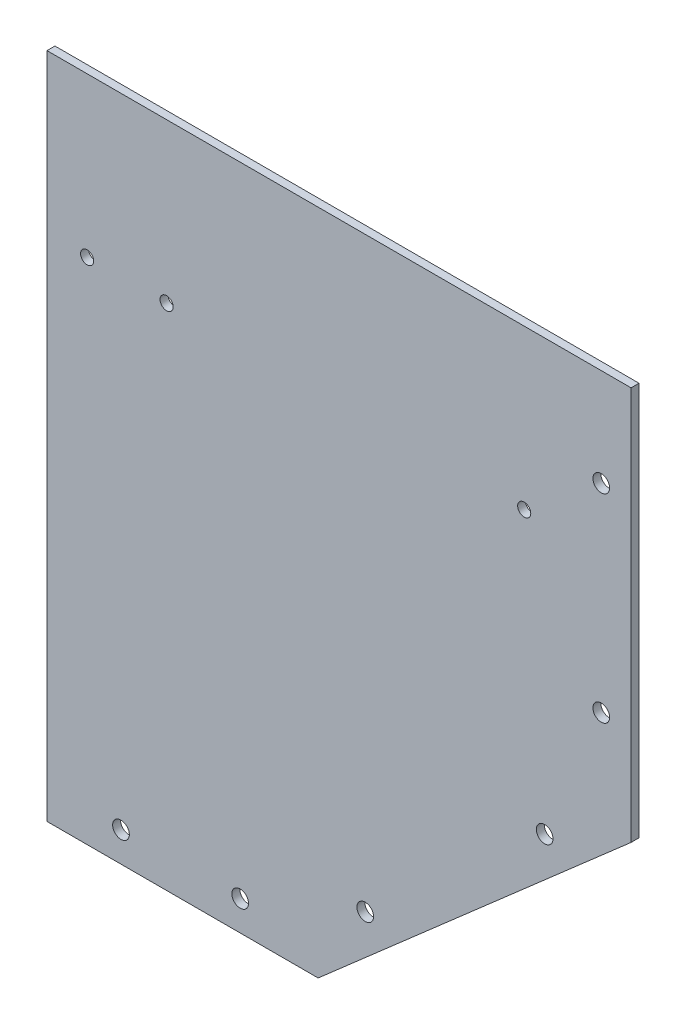
ISO-10303-21;
HEADER;
FILE_DESCRIPTION(('STEP AP214'),'2;1');
FILE_NAME('part.step','',(''),(''),'','','');
FILE_SCHEMA(('AUTOMOTIVE_DESIGN { 1 0 10303 214 1 1 1 1 }'));
ENDSEC;
DATA;
#1=APPLICATION_CONTEXT('core data for automotive mechanical design processes');
#2=APPLICATION_PROTOCOL_DEFINITION('international standard','automotive_design',2000,#1);
#3=PRODUCT_CONTEXT('',#1,'mechanical');
#4=PRODUCT('Part','Part','',(#3));
#5=PRODUCT_RELATED_PRODUCT_CATEGORY('part','',(#4));
#6=PRODUCT_DEFINITION_FORMATION('','',#4);
#7=PRODUCT_DEFINITION_CONTEXT('part definition',#1,'design');
#8=PRODUCT_DEFINITION('design','',#6,#7);
#9=PRODUCT_DEFINITION_SHAPE('','',#8);
#10=(LENGTH_UNIT() NAMED_UNIT(*) SI_UNIT(.MILLI.,.METRE.));
#11=(NAMED_UNIT(*) PLANE_ANGLE_UNIT() SI_UNIT($,.RADIAN.));
#12=(NAMED_UNIT(*) SI_UNIT($,.STERADIAN.) SOLID_ANGLE_UNIT());
#13=UNCERTAINTY_MEASURE_WITH_UNIT(LENGTH_MEASURE(1.E-05),#10,'distance_accuracy_value','');
#14=(GEOMETRIC_REPRESENTATION_CONTEXT(3) GLOBAL_UNCERTAINTY_ASSIGNED_CONTEXT((#13)) GLOBAL_UNIT_ASSIGNED_CONTEXT((#10,
#11,#12)) REPRESENTATION_CONTEXT('',''));
#15=CARTESIAN_POINT('',(0.,0.,0.));
#16=DIRECTION('',(0.,0.,1.));
#17=DIRECTION('',(1.,0.,0.));
#18=AXIS2_PLACEMENT_3D('',#15,#16,#17);
#19=CARTESIAN_POINT('',(0.,0.,2.));
#20=DIRECTION('',(0.,1.,0.));
#21=DIRECTION('',(0.,0.,1.));
#22=AXIS2_PLACEMENT_3D('',#19,#20,#21);
#23=PLANE('',#22);
#24=DIRECTION('',(1.,0.,0.));
#25=VECTOR('',#24,1.);
#26=CARTESIAN_POINT('',(0.,0.,0.));
#27=LINE('',#26,#25);
#28=CARTESIAN_POINT('',(0.,0.,0.));
#29=VERTEX_POINT('',#28);
#30=CARTESIAN_POINT('',(68.24,0.,0.));
#31=VERTEX_POINT('',#30);
#32=EDGE_CURVE('E133',#29,#31,#27,.T.);
#33=ORIENTED_EDGE('',*,*,#32,.T.);
#34=DIRECTION('',(0.,0.,-1.));
#35=VECTOR('',#34,1.);
#36=CARTESIAN_POINT('',(68.24,0.,2.));
#37=LINE('',#36,#35);
#38=CARTESIAN_POINT('',(68.24,0.,2.));
#39=VERTEX_POINT('',#38);
#40=EDGE_CURVE('E11',#39,#31,#37,.T.);
#41=ORIENTED_EDGE('',*,*,#40,.F.);
#42=DIRECTION('',(1.,0.,0.));
#43=VECTOR('',#42,1.);
#44=CARTESIAN_POINT('',(0.,0.,2.));
#45=LINE('',#44,#43);
#46=CARTESIAN_POINT('',(0.,0.,2.));
#47=VERTEX_POINT('',#46);
#48=EDGE_CURVE('E179',#47,#39,#45,.T.);
#49=ORIENTED_EDGE('',*,*,#48,.F.);
#50=DIRECTION('',(0.,0.,-1.));
#51=VECTOR('',#50,1.);
#52=CARTESIAN_POINT('',(0.,0.,2.));
#53=LINE('',#52,#51);
#54=EDGE_CURVE('E110',#47,#29,#53,.T.);
#55=ORIENTED_EDGE('',*,*,#54,.T.);
#56=EDGE_LOOP('',(#33,#41,#49,#55));
#57=FACE_BOUND('',#56,.T.);
#58=ADVANCED_FACE('F37',(#57),#23,.F.);
#59=CARTESIAN_POINT('',(29.5956067368034,-33.8186969825855,2.));
#60=DIRECTION('',(-0.658558128911921,0.752529860433478,0.));
#61=DIRECTION('',(-0.752529860433478,-0.658558128911921,0.));
#62=AXIS2_PLACEMENT_3D('',#59,#60,#61);
#63=PLANE('',#62);
#64=DIRECTION('',(0.752529860433478,0.658558128911921,0.));
#65=VECTOR('',#64,1.);
#66=CARTESIAN_POINT('',(29.5956067368034,-33.8186969825855,0.));
#67=LINE('',#66,#65);
#68=CARTESIAN_POINT('',(146.992249894363,68.9181081906326,0.));
#69=VERTEX_POINT('',#68);
#70=EDGE_CURVE('E136',#31,#69,#67,.T.);
#71=ORIENTED_EDGE('',*,*,#70,.T.);
#72=DIRECTION('',(0.,0.,-1.));
#73=VECTOR('',#72,1.);
#74=CARTESIAN_POINT('',(146.992249894363,68.9181081906326,2.));
#75=LINE('',#74,#73);
#76=CARTESIAN_POINT('',(146.992249894363,68.9181081906326,2.));
#77=VERTEX_POINT('',#76);
#78=EDGE_CURVE('E47',#77,#69,#75,.T.);
#79=ORIENTED_EDGE('',*,*,#78,.F.);
#80=DIRECTION('',(0.752529860433478,0.658558128911921,0.));
#81=VECTOR('',#80,1.);
#82=CARTESIAN_POINT('',(29.5956067368034,-33.8186969825855,2.));
#83=LINE('',#82,#81);
#84=EDGE_CURVE('E90',#39,#77,#83,.T.);
#85=ORIENTED_EDGE('',*,*,#84,.F.);
#86=ORIENTED_EDGE('',*,*,#40,.T.);
#87=EDGE_LOOP('',(#71,#79,#85,#86));
#88=FACE_BOUND('',#87,.T.);
#89=ADVANCED_FACE('F184',(#88),#63,.F.);
#90=CARTESIAN_POINT('',(146.992249894364,1.23517305978068E-13,2.));
#91=DIRECTION('',(-1.,0.,0.));
#92=DIRECTION('',(0.,-1.,0.));
#93=AXIS2_PLACEMENT_3D('',#90,#91,#92);
#94=PLANE('',#93);
#95=DIRECTION('',(0.,1.,0.));
#96=VECTOR('',#95,1.);
#97=CARTESIAN_POINT('',(146.992249894364,1.23517305978068E-13,0.));
#98=LINE('',#97,#96);
#99=CARTESIAN_POINT('',(146.992249894363,168.01,0.));
#100=VERTEX_POINT('',#99);
#101=EDGE_CURVE('E105',#69,#100,#98,.T.);
#102=ORIENTED_EDGE('',*,*,#101,.T.);
#103=DIRECTION('',(0.,0.,-1.));
#104=VECTOR('',#103,1.);
#105=CARTESIAN_POINT('',(146.992249894363,168.01,2.));
#106=LINE('',#105,#104);
#107=CARTESIAN_POINT('',(146.992249894363,168.01,2.));
#108=VERTEX_POINT('',#107);
#109=EDGE_CURVE('E102',#108,#100,#106,.T.);
#110=ORIENTED_EDGE('',*,*,#109,.F.);
#111=DIRECTION('',(0.,1.,0.));
#112=VECTOR('',#111,1.);
#113=CARTESIAN_POINT('',(146.992249894364,1.23517305978068E-13,2.));
#114=LINE('',#113,#112);
#115=EDGE_CURVE('E94',#77,#108,#114,.T.);
#116=ORIENTED_EDGE('',*,*,#115,.F.);
#117=ORIENTED_EDGE('',*,*,#78,.T.);
#118=EDGE_LOOP('',(#102,#110,#116,#117));
#119=FACE_BOUND('',#118,.T.);
#120=ADVANCED_FACE('F103',(#119),#94,.F.);
#121=CARTESIAN_POINT('',(0.,168.01,2.));
#122=DIRECTION('',(0.,-1.,0.));
#123=DIRECTION('',(1.,0.,0.));
#124=AXIS2_PLACEMENT_3D('',#121,#122,#123);
#125=PLANE('',#124);
#126=DIRECTION('',(-1.,0.,0.));
#127=VECTOR('',#126,1.);
#128=CARTESIAN_POINT('',(0.,168.01,0.));
#129=LINE('',#128,#127);
#130=CARTESIAN_POINT('',(0.,168.01,0.));
#131=VERTEX_POINT('',#130);
#132=EDGE_CURVE('E76',#100,#131,#129,.T.);
#133=ORIENTED_EDGE('',*,*,#132,.T.);
#134=DIRECTION('',(0.,0.,-1.));
#135=VECTOR('',#134,1.);
#136=CARTESIAN_POINT('',(0.,168.01,2.));
#137=LINE('',#136,#135);
#138=CARTESIAN_POINT('',(0.,168.01,2.));
#139=VERTEX_POINT('',#138);
#140=EDGE_CURVE('E106',#139,#131,#137,.T.);
#141=ORIENTED_EDGE('',*,*,#140,.F.);
#142=DIRECTION('',(-1.,0.,0.));
#143=VECTOR('',#142,1.);
#144=CARTESIAN_POINT('',(0.,168.01,2.));
#145=LINE('',#144,#143);
#146=EDGE_CURVE('E98',#108,#139,#145,.T.);
#147=ORIENTED_EDGE('',*,*,#146,.F.);
#148=ORIENTED_EDGE('',*,*,#109,.T.);
#149=EDGE_LOOP('',(#133,#141,#147,#148));
#150=FACE_BOUND('',#149,.T.);
#151=ADVANCED_FACE('F108',(#150),#125,.F.);
#152=CARTESIAN_POINT('',(48.62,7.5,2.));
#153=DIRECTION('',(0.,0.,-1.));
#154=DIRECTION('',(-1.,0.,0.));
#155=AXIS2_PLACEMENT_3D('',#152,#153,#154);
#156=CYLINDRICAL_SURFACE('',#155,2.1);
#157=CARTESIAN_POINT('',(48.62,7.5,2.));
#158=DIRECTION('',(0.,0.,1.));
#159=DIRECTION('',(1.,0.,0.));
#160=AXIS2_PLACEMENT_3D('',#157,#158,#159);
#161=CIRCLE('',#160,2.1);
#162=CARTESIAN_POINT('',(50.72,7.5,2.));
#163=VERTEX_POINT('',#162);
#164=EDGE_CURVE('E176',#163,#163,#161,.T.);
#165=ORIENTED_EDGE('',*,*,#164,.T.);
#166=EDGE_LOOP('',(#165));
#167=FACE_BOUND('',#166,.T.);
#168=CARTESIAN_POINT('',(48.62,7.5,0.));
#169=DIRECTION('',(0.,0.,1.));
#170=DIRECTION('',(1.,0.,0.));
#171=AXIS2_PLACEMENT_3D('',#168,#169,#170);
#172=CIRCLE('',#171,2.1);
#173=CARTESIAN_POINT('',(50.72,7.5,0.));
#174=VERTEX_POINT('',#173);
#175=EDGE_CURVE('E130',#174,#174,#172,.T.);
#176=ORIENTED_EDGE('',*,*,#175,.F.);
#177=EDGE_LOOP('',(#176));
#178=FACE_BOUND('',#177,.T.);
#179=ADVANCED_FACE('F210',(#167,#178),#156,.F.);
#180=CARTESIAN_POINT('',(18.62,7.5,2.));
#181=DIRECTION('',(0.,0.,-1.));
#182=DIRECTION('',(-1.,0.,0.));
#183=AXIS2_PLACEMENT_3D('',#180,#181,#182);
#184=CYLINDRICAL_SURFACE('',#183,2.1);
#185=CARTESIAN_POINT('',(18.62,7.5,2.));
#186=DIRECTION('',(0.,0.,1.));
#187=DIRECTION('',(1.,0.,0.));
#188=AXIS2_PLACEMENT_3D('',#185,#186,#187);
#189=CIRCLE('',#188,2.1);
#190=CARTESIAN_POINT('',(20.72,7.5,2.));
#191=VERTEX_POINT('',#190);
#192=EDGE_CURVE('E173',#191,#191,#189,.T.);
#193=ORIENTED_EDGE('',*,*,#192,.T.);
#194=EDGE_LOOP('',(#193));
#195=FACE_BOUND('',#194,.T.);
#196=CARTESIAN_POINT('',(18.62,7.5,0.));
#197=DIRECTION('',(0.,0.,1.));
#198=DIRECTION('',(1.,0.,0.));
#199=AXIS2_PLACEMENT_3D('',#196,#197,#198);
#200=CIRCLE('',#199,2.1);
#201=CARTESIAN_POINT('',(20.72,7.5,0.));
#202=VERTEX_POINT('',#201);
#203=EDGE_CURVE('E127',#202,#202,#200,.T.);
#204=ORIENTED_EDGE('',*,*,#203,.F.);
#205=EDGE_LOOP('',(#204));
#206=FACE_BOUND('',#205,.T.);
#207=ADVANCED_FACE('F213',(#195,#206),#184,.F.);
#208=CARTESIAN_POINT('',(139.492249894363,143.468108190633,2.));
#209=DIRECTION('',(0.,0.,-1.));
#210=DIRECTION('',(-1.,0.,0.));
#211=AXIS2_PLACEMENT_3D('',#208,#209,#210);
#212=CYLINDRICAL_SURFACE('',#211,2.09999999999999);
#213=CARTESIAN_POINT('',(139.492249894363,143.468108190633,2.));
#214=DIRECTION('',(0.,0.,1.));
#215=DIRECTION('',(1.,0.,0.));
#216=AXIS2_PLACEMENT_3D('',#213,#214,#215);
#217=CIRCLE('',#216,2.09999999999999);
#218=CARTESIAN_POINT('',(141.592249894363,143.468108190633,2.));
#219=VERTEX_POINT('',#218);
#220=EDGE_CURVE('E170',#219,#219,#217,.T.);
#221=ORIENTED_EDGE('',*,*,#220,.T.);
#222=EDGE_LOOP('',(#221));
#223=FACE_BOUND('',#222,.T.);
#224=CARTESIAN_POINT('',(139.492249894363,143.468108190633,0.));
#225=DIRECTION('',(0.,0.,1.));
#226=DIRECTION('',(1.,0.,0.));
#227=AXIS2_PLACEMENT_3D('',#224,#225,#226);
#228=CIRCLE('',#227,2.09999999999999);
#229=CARTESIAN_POINT('',(141.592249894363,143.468108190633,0.));
#230=VERTEX_POINT('',#229);
#231=EDGE_CURVE('E124',#230,#230,#228,.T.);
#232=ORIENTED_EDGE('',*,*,#231,.F.);
#233=EDGE_LOOP('',(#232));
#234=FACE_BOUND('',#233,.T.);
#235=ADVANCED_FACE('F217',(#223,#234),#212,.F.);
#236=CARTESIAN_POINT('',(139.492249894363,93.4681081906326,2.));
#237=DIRECTION('',(0.,0.,-1.));
#238=DIRECTION('',(-1.,0.,0.));
#239=AXIS2_PLACEMENT_3D('',#236,#237,#238);
#240=CYLINDRICAL_SURFACE('',#239,2.09999999999999);
#241=CARTESIAN_POINT('',(139.492249894363,93.4681081906326,2.));
#242=DIRECTION('',(0.,0.,1.));
#243=DIRECTION('',(1.,0.,0.));
#244=AXIS2_PLACEMENT_3D('',#241,#242,#243);
#245=CIRCLE('',#244,2.09999999999999);
#246=CARTESIAN_POINT('',(141.592249894363,93.4681081906326,2.));
#247=VERTEX_POINT('',#246);
#248=EDGE_CURVE('E167',#247,#247,#245,.T.);
#249=ORIENTED_EDGE('',*,*,#248,.T.);
#250=EDGE_LOOP('',(#249));
#251=FACE_BOUND('',#250,.T.);
#252=CARTESIAN_POINT('',(139.492249894363,93.4681081906326,0.));
#253=DIRECTION('',(0.,0.,1.));
#254=DIRECTION('',(1.,0.,0.));
#255=AXIS2_PLACEMENT_3D('',#252,#253,#254);
#256=CIRCLE('',#255,2.09999999999999);
#257=CARTESIAN_POINT('',(141.592249894363,93.4681081906326,0.));
#258=VERTEX_POINT('',#257);
#259=EDGE_CURVE('E121',#258,#258,#256,.T.);
#260=ORIENTED_EDGE('',*,*,#259,.F.);
#261=EDGE_LOOP('',(#260));
#262=FACE_BOUND('',#261,.T.);
#263=ADVANCED_FACE('F221',(#251,#262),#240,.F.);
#264=CARTESIAN_POINT('',(80.0972805180358,20.3429913905652,2.));
#265=DIRECTION('',(0.,0.,-1.));
#266=DIRECTION('',(-1.,0.,0.));
#267=AXIS2_PLACEMENT_3D('',#264,#265,#266);
#268=CYLINDRICAL_SURFACE('',#267,2.1);
#269=CARTESIAN_POINT('',(80.0972805180358,20.3429913905652,2.));
#270=DIRECTION('',(0.,0.,1.));
#271=DIRECTION('',(1.,0.,0.));
#272=AXIS2_PLACEMENT_3D('',#269,#270,#271);
#273=CIRCLE('',#272,2.1);
#274=CARTESIAN_POINT('',(82.1972805180358,20.3429913905652,2.));
#275=VERTEX_POINT('',#274);
#276=EDGE_CURVE('E164',#275,#275,#273,.T.);
#277=ORIENTED_EDGE('',*,*,#276,.T.);
#278=EDGE_LOOP('',(#277));
#279=FACE_BOUND('',#278,.T.);
#280=CARTESIAN_POINT('',(80.0972805180358,20.3429913905652,0.));
#281=DIRECTION('',(0.,0.,1.));
#282=DIRECTION('',(1.,0.,0.));
#283=AXIS2_PLACEMENT_3D('',#280,#281,#282);
#284=CIRCLE('',#283,2.1);
#285=CARTESIAN_POINT('',(82.1972805180358,20.3429913905652,0.));
#286=VERTEX_POINT('',#285);
#287=EDGE_CURVE('E117',#286,#286,#284,.T.);
#288=ORIENTED_EDGE('',*,*,#287,.F.);
#289=EDGE_LOOP('',(#288));
#290=FACE_BOUND('',#289,.T.);
#291=ADVANCED_FACE('F224',(#279,#290),#268,.F.);
#292=CARTESIAN_POINT('',(125.249072144044,59.8564791252805,2.));
#293=DIRECTION('',(0.,0.,-1.));
#294=DIRECTION('',(-1.,0.,0.));
#295=AXIS2_PLACEMENT_3D('',#292,#293,#294);
#296=CYLINDRICAL_SURFACE('',#295,2.09999999999999);
#297=CARTESIAN_POINT('',(125.249072144044,59.8564791252805,2.));
#298=DIRECTION('',(0.,0.,1.));
#299=DIRECTION('',(1.,0.,0.));
#300=AXIS2_PLACEMENT_3D('',#297,#298,#299);
#301=CIRCLE('',#300,2.09999999999999);
#302=CARTESIAN_POINT('',(127.349072144044,59.8564791252805,2.));
#303=VERTEX_POINT('',#302);
#304=EDGE_CURVE('E141',#303,#303,#301,.T.);
#305=ORIENTED_EDGE('',*,*,#304,.T.);
#306=EDGE_LOOP('',(#305));
#307=FACE_BOUND('',#306,.T.);
#308=CARTESIAN_POINT('',(125.249072144044,59.8564791252805,0.));
#309=DIRECTION('',(0.,0.,1.));
#310=DIRECTION('',(1.,0.,0.));
#311=AXIS2_PLACEMENT_3D('',#308,#309,#310);
#312=CIRCLE('',#311,2.09999999999999);
#313=CARTESIAN_POINT('',(127.349072144044,59.8564791252805,0.));
#314=VERTEX_POINT('',#313);
#315=EDGE_CURVE('E114',#314,#314,#312,.T.);
#316=ORIENTED_EDGE('',*,*,#315,.F.);
#317=EDGE_LOOP('',(#316));
#318=FACE_BOUND('',#317,.T.);
#319=ADVANCED_FACE('F39',(#307,#318),#296,.F.);
#320=CARTESIAN_POINT('',(0.,0.,2.));
#321=DIRECTION('',(1.,0.,0.));
#322=DIRECTION('',(0.,1.,0.));
#323=AXIS2_PLACEMENT_3D('',#320,#321,#322);
#324=PLANE('',#323);
#325=DIRECTION('',(0.,-1.,0.));
#326=VECTOR('',#325,1.);
#327=CARTESIAN_POINT('',(0.,0.,0.));
#328=LINE('',#327,#326);
#329=EDGE_CURVE('E82',#131,#29,#328,.T.);
#330=ORIENTED_EDGE('',*,*,#329,.T.);
#331=ORIENTED_EDGE('',*,*,#54,.F.);
#332=DIRECTION('',(0.,-1.,0.));
#333=VECTOR('',#332,1.);
#334=CARTESIAN_POINT('',(0.,0.,2.));
#335=LINE('',#334,#333);
#336=EDGE_CURVE('E56',#139,#47,#335,.T.);
#337=ORIENTED_EDGE('',*,*,#336,.F.);
#338=ORIENTED_EDGE('',*,*,#140,.T.);
#339=EDGE_LOOP('',(#330,#331,#337,#338));
#340=FACE_BOUND('',#339,.T.);
#341=ADVANCED_FACE('F198',(#340),#324,.F.);
#342=CARTESIAN_POINT('',(0.,0.,2.));
#343=DIRECTION('',(0.,0.,1.));
#344=DIRECTION('',(1.,0.,0.));
#345=AXIS2_PLACEMENT_3D('',#342,#343,#344);
#346=PLANE('',#345);
#347=CARTESIAN_POINT('',(10.1,128.01,2.));
#348=DIRECTION('',(0.,0.,1.));
#349=DIRECTION('',(1.,0.,0.));
#350=AXIS2_PLACEMENT_3D('',#347,#348,#349);
#351=CIRCLE('',#350,1.64999999999999);
#352=CARTESIAN_POINT('',(11.75,128.01,2.));
#353=VERTEX_POINT('',#352);
#354=EDGE_CURVE('E159',#353,#353,#351,.T.);
#355=ORIENTED_EDGE('',*,*,#354,.F.);
#356=EDGE_LOOP('',(#355));
#357=FACE_BOUND('',#356,.T.);
#358=CARTESIAN_POINT('',(30.1,128.01,2.));
#359=DIRECTION('',(0.,0.,1.));
#360=DIRECTION('',(1.,0.,0.));
#361=AXIS2_PLACEMENT_3D('',#358,#359,#360);
#362=CIRCLE('',#361,1.64999999999999);
#363=CARTESIAN_POINT('',(31.75,128.01,2.));
#364=VERTEX_POINT('',#363);
#365=EDGE_CURVE('E149',#364,#364,#362,.T.);
#366=ORIENTED_EDGE('',*,*,#365,.F.);
#367=EDGE_LOOP('',(#366));
#368=FACE_BOUND('',#367,.T.);
#369=CARTESIAN_POINT('',(120.1,128.01,2.));
#370=DIRECTION('',(0.,0.,1.));
#371=DIRECTION('',(1.,0.,0.));
#372=AXIS2_PLACEMENT_3D('',#369,#370,#371);
#373=CIRCLE('',#372,1.64999999999998);
#374=CARTESIAN_POINT('',(121.75,128.01,2.));
#375=VERTEX_POINT('',#374);
#376=EDGE_CURVE('E146',#375,#375,#373,.T.);
#377=ORIENTED_EDGE('',*,*,#376,.F.);
#378=EDGE_LOOP('',(#377));
#379=FACE_BOUND('',#378,.T.);
#380=ORIENTED_EDGE('',*,*,#304,.F.);
#381=EDGE_LOOP('',(#380));
#382=FACE_BOUND('',#381,.T.);
#383=ORIENTED_EDGE('',*,*,#276,.F.);
#384=EDGE_LOOP('',(#383));
#385=FACE_BOUND('',#384,.T.);
#386=ORIENTED_EDGE('',*,*,#248,.F.);
#387=EDGE_LOOP('',(#386));
#388=FACE_BOUND('',#387,.T.);
#389=ORIENTED_EDGE('',*,*,#220,.F.);
#390=EDGE_LOOP('',(#389));
#391=FACE_BOUND('',#390,.T.);
#392=ORIENTED_EDGE('',*,*,#192,.F.);
#393=EDGE_LOOP('',(#392));
#394=FACE_BOUND('',#393,.T.);
#395=ORIENTED_EDGE('',*,*,#164,.F.);
#396=EDGE_LOOP('',(#395));
#397=FACE_BOUND('',#396,.T.);
#398=ORIENTED_EDGE('',*,*,#48,.T.);
#399=ORIENTED_EDGE('',*,*,#84,.T.);
#400=ORIENTED_EDGE('',*,*,#115,.T.);
#401=ORIENTED_EDGE('',*,*,#146,.T.);
#402=ORIENTED_EDGE('',*,*,#336,.T.);
#403=EDGE_LOOP('',(#398,#399,#400,#401,#402));
#404=FACE_BOUND('',#403,.T.);
#405=ADVANCED_FACE('F96',(#357,#368,#379,#382,#385,#388,#391,#394,#397,#404),#346,.T.);
#406=CARTESIAN_POINT('',(0.,0.,0.));
#407=DIRECTION('',(0.,0.,1.));
#408=DIRECTION('',(1.,0.,0.));
#409=AXIS2_PLACEMENT_3D('',#406,#407,#408);
#410=PLANE('',#409);
#411=CARTESIAN_POINT('',(10.1,128.01,0.));
#412=DIRECTION('',(0.,0.,1.));
#413=DIRECTION('',(1.,0.,0.));
#414=AXIS2_PLACEMENT_3D('',#411,#412,#413);
#415=CIRCLE('',#414,1.64999999999999);
#416=CARTESIAN_POINT('',(11.75,128.01,0.));
#417=VERTEX_POINT('',#416);
#418=EDGE_CURVE('E41',#417,#417,#415,.T.);
#419=ORIENTED_EDGE('',*,*,#418,.T.);
#420=EDGE_LOOP('',(#419));
#421=FACE_BOUND('',#420,.T.);
#422=CARTESIAN_POINT('',(30.1,128.01,0.));
#423=DIRECTION('',(0.,0.,1.));
#424=DIRECTION('',(1.,0.,0.));
#425=AXIS2_PLACEMENT_3D('',#422,#423,#424);
#426=CIRCLE('',#425,1.64999999999999);
#427=CARTESIAN_POINT('',(31.75,128.01,0.));
#428=VERTEX_POINT('',#427);
#429=EDGE_CURVE('E147',#428,#428,#426,.T.);
#430=ORIENTED_EDGE('',*,*,#429,.T.);
#431=EDGE_LOOP('',(#430));
#432=FACE_BOUND('',#431,.T.);
#433=CARTESIAN_POINT('',(120.1,128.01,0.));
#434=DIRECTION('',(0.,0.,1.));
#435=DIRECTION('',(1.,0.,0.));
#436=AXIS2_PLACEMENT_3D('',#433,#434,#435);
#437=CIRCLE('',#436,1.64999999999998);
#438=CARTESIAN_POINT('',(121.75,128.01,0.));
#439=VERTEX_POINT('',#438);
#440=EDGE_CURVE('E118',#439,#439,#437,.T.);
#441=ORIENTED_EDGE('',*,*,#440,.T.);
#442=EDGE_LOOP('',(#441));
#443=FACE_BOUND('',#442,.T.);
#444=ORIENTED_EDGE('',*,*,#315,.T.);
#445=EDGE_LOOP('',(#444));
#446=FACE_BOUND('',#445,.T.);
#447=ORIENTED_EDGE('',*,*,#287,.T.);
#448=EDGE_LOOP('',(#447));
#449=FACE_BOUND('',#448,.T.);
#450=ORIENTED_EDGE('',*,*,#259,.T.);
#451=EDGE_LOOP('',(#450));
#452=FACE_BOUND('',#451,.T.);
#453=ORIENTED_EDGE('',*,*,#231,.T.);
#454=EDGE_LOOP('',(#453));
#455=FACE_BOUND('',#454,.T.);
#456=ORIENTED_EDGE('',*,*,#203,.T.);
#457=EDGE_LOOP('',(#456));
#458=FACE_BOUND('',#457,.T.);
#459=ORIENTED_EDGE('',*,*,#175,.T.);
#460=EDGE_LOOP('',(#459));
#461=FACE_BOUND('',#460,.T.);
#462=ORIENTED_EDGE('',*,*,#32,.F.);
#463=ORIENTED_EDGE('',*,*,#329,.F.);
#464=ORIENTED_EDGE('',*,*,#132,.F.);
#465=ORIENTED_EDGE('',*,*,#101,.F.);
#466=ORIENTED_EDGE('',*,*,#70,.F.);
#467=EDGE_LOOP('',(#462,#463,#464,#465,#466));
#468=FACE_BOUND('',#467,.T.);
#469=ADVANCED_FACE('F186',(#421,#432,#443,#446,#449,#452,#455,#458,#461,#468),#410,.F.);
#470=CARTESIAN_POINT('',(120.1,128.01,2.));
#471=DIRECTION('',(0.,0.,1.));
#472=DIRECTION('',(1.,0.,0.));
#473=AXIS2_PLACEMENT_3D('',#470,#471,#472);
#474=CYLINDRICAL_SURFACE('',#473,1.64999999999998);
#475=ORIENTED_EDGE('',*,*,#376,.T.);
#476=EDGE_LOOP('',(#475));
#477=FACE_BOUND('',#476,.T.);
#478=ORIENTED_EDGE('',*,*,#440,.F.);
#479=EDGE_LOOP('',(#478));
#480=FACE_BOUND('',#479,.T.);
#481=ADVANCED_FACE('F188',(#477,#480),#474,.F.);
#482=CARTESIAN_POINT('',(30.1,128.01,2.));
#483=DIRECTION('',(0.,0.,1.));
#484=DIRECTION('',(1.,0.,0.));
#485=AXIS2_PLACEMENT_3D('',#482,#483,#484);
#486=CYLINDRICAL_SURFACE('',#485,1.64999999999999);
#487=ORIENTED_EDGE('',*,*,#365,.T.);
#488=EDGE_LOOP('',(#487));
#489=FACE_BOUND('',#488,.T.);
#490=ORIENTED_EDGE('',*,*,#429,.F.);
#491=EDGE_LOOP('',(#490));
#492=FACE_BOUND('',#491,.T.);
#493=ADVANCED_FACE('F195',(#489,#492),#486,.F.);
#494=CARTESIAN_POINT('',(10.1,128.01,2.));
#495=DIRECTION('',(0.,0.,1.));
#496=DIRECTION('',(1.,0.,0.));
#497=AXIS2_PLACEMENT_3D('',#494,#495,#496);
#498=CYLINDRICAL_SURFACE('',#497,1.64999999999999);
#499=ORIENTED_EDGE('',*,*,#354,.T.);
#500=EDGE_LOOP('',(#499));
#501=FACE_BOUND('',#500,.T.);
#502=ORIENTED_EDGE('',*,*,#418,.F.);
#503=EDGE_LOOP('',(#502));
#504=FACE_BOUND('',#503,.T.);
#505=ADVANCED_FACE('F334',(#501,#504),#498,.F.);
#506=CLOSED_SHELL('',(#58,#89,#120,#151,#179,#207,#235,#263,#291,#319,#341,#405,#469,#481,#493,#505));
#507=MANIFOLD_SOLID_BREP('B2',#506);
#508=ADVANCED_BREP_SHAPE_REPRESENTATION('',(#18,#507),#14);
#509=SHAPE_DEFINITION_REPRESENTATION(#9,#508);
ENDSEC;
END-ISO-10303-21;
